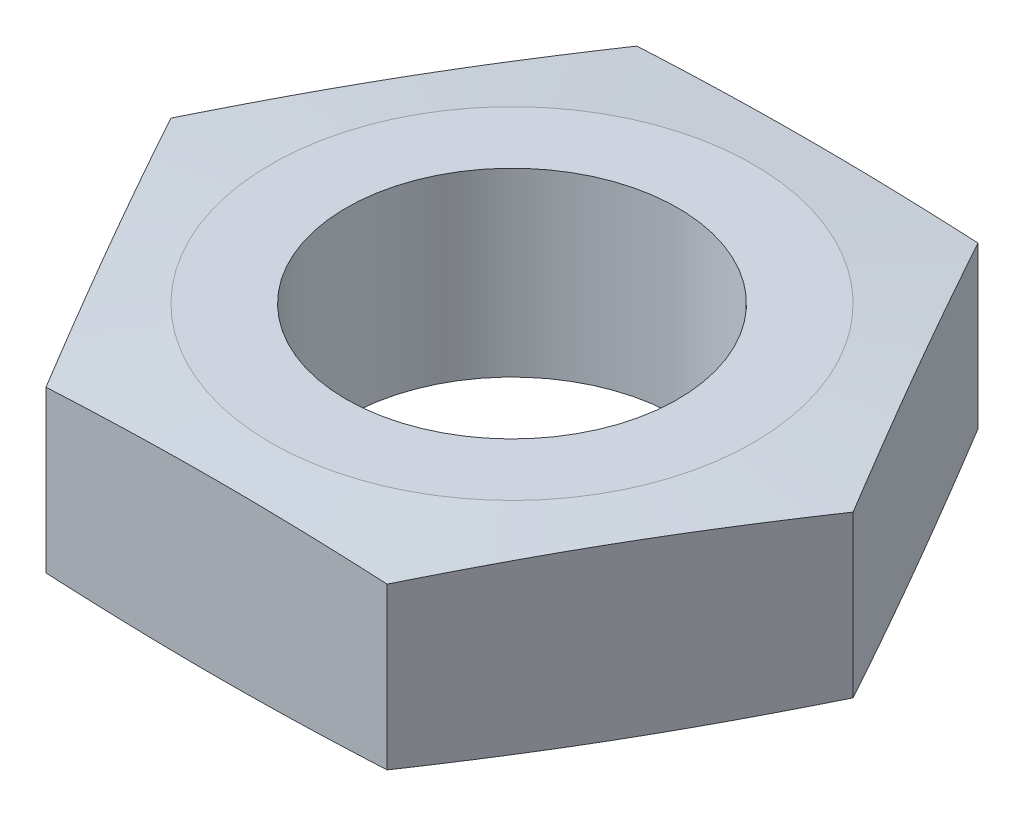
ISO-10303-21;
HEADER;
FILE_DESCRIPTION(('STEP AP214'),'2;1');
FILE_NAME('part.step','',(''),(''),'','','');
FILE_SCHEMA(('AUTOMOTIVE_DESIGN { 1 0 10303 214 1 1 1 1 }'));
ENDSEC;
DATA;
#1=APPLICATION_CONTEXT('core data for automotive mechanical design processes');
#2=APPLICATION_PROTOCOL_DEFINITION('international standard','automotive_design',2000,#1);
#3=PRODUCT_CONTEXT('',#1,'mechanical');
#4=PRODUCT('Part','Part','',(#3));
#5=PRODUCT_RELATED_PRODUCT_CATEGORY('part','',(#4));
#6=PRODUCT_DEFINITION_FORMATION('','',#4);
#7=PRODUCT_DEFINITION_CONTEXT('part definition',#1,'design');
#8=PRODUCT_DEFINITION('design','',#6,#7);
#9=PRODUCT_DEFINITION_SHAPE('','',#8);
#10=(LENGTH_UNIT() NAMED_UNIT(*) SI_UNIT(.MILLI.,.METRE.));
#11=(NAMED_UNIT(*) PLANE_ANGLE_UNIT() SI_UNIT($,.RADIAN.));
#12=(NAMED_UNIT(*) SI_UNIT($,.STERADIAN.) SOLID_ANGLE_UNIT());
#13=UNCERTAINTY_MEASURE_WITH_UNIT(LENGTH_MEASURE(1.E-05),#10,'distance_accuracy_value','');
#14=(GEOMETRIC_REPRESENTATION_CONTEXT(3) GLOBAL_UNCERTAINTY_ASSIGNED_CONTEXT((#13)) GLOBAL_UNIT_ASSIGNED_CONTEXT((#10,
#11,#12)) REPRESENTATION_CONTEXT('',''));
#15=CARTESIAN_POINT('',(0.,0.,0.));
#16=DIRECTION('',(0.,0.,1.));
#17=DIRECTION('',(1.,0.,0.));
#18=AXIS2_PLACEMENT_3D('',#15,#16,#17);
#19=CARTESIAN_POINT('',(-2.82901631902917,1.5,4.9));
#20=DIRECTION('',(0.,0.,-1.));
#21=DIRECTION('',(-1.,0.,0.));
#22=AXIS2_PLACEMENT_3D('',#19,#20,#21);
#23=PLANE('',#22);
#24=CARTESIAN_POINT('',(-7.47109907735667,-1.00653863304741,4.9));
#25=CARTESIAN_POINT('',(-7.24856236014099,-1.02514412298883,4.9));
#26=CARTESIAN_POINT('',(-7.02600547216599,-1.04350771336726,4.9));
#27=CARTESIAN_POINT('',(-6.58084135956366,-1.0796312885138,4.9));
#28=CARTESIAN_POINT('',(-6.35823413462823,-1.09739126948086,4.9));
#29=CARTESIAN_POINT('',(-5.69026658544264,-1.14959039421229,4.9));
#30=CARTESIAN_POINT('',(-5.24481993569117,-1.18294367654422,4.9));
#31=CARTESIAN_POINT('',(-4.35409507703629,-1.24527219436755,4.9));
#32=CARTESIAN_POINT('',(-3.90881719743005,-1.27425207364141,4.9));
#33=CARTESIAN_POINT('',(-3.01787712788772,-1.32566836961985,4.9));
#34=CARTESIAN_POINT('',(-2.5722149480883,-1.34810495392267,4.9));
#35=CARTESIAN_POINT('',(-1.90310838277142,-1.37473844982548,4.9));
#36=CARTESIAN_POINT('',(-1.67980405540288,-1.38244917287994,4.9));
#37=CARTESIAN_POINT('',(-1.23311960808795,-1.39517553267675,4.9));
#38=CARTESIAN_POINT('',(-1.00973948903471,-1.40019120014511,4.9));
#39=CARTESIAN_POINT('',(-0.562943374380458,-1.40726997751627,4.9));
#40=CARTESIAN_POINT('',(-0.339527381266118,-1.40933324179001,4.9));
#41=CARTESIAN_POINT('',(0.107311956766196,-1.41039167435151,4.9));
#42=CARTESIAN_POINT('',(0.330735301682421,-1.40938684336388,4.9));
#43=CARTESIAN_POINT('',(0.777659835380096,-1.40436501603405,4.9));
#44=CARTESIAN_POINT('',(1.00116100688973,-1.40034650689583,4.9));
#45=CARTESIAN_POINT('',(1.44809643611479,-1.38951062191602,4.9));
#46=CARTESIAN_POINT('',(1.67153069306241,-1.38269321510401,4.9));
#47=CARTESIAN_POINT('',(2.34172762215674,-1.35852085026062,4.9));
#48=CARTESIAN_POINT('',(2.78835626533211,-1.33744613842943,4.9));
#49=CARTESIAN_POINT('',(3.66354970944947,-1.28923839010267,4.9));
#50=CARTESIAN_POINT('',(4.09213031646093,-1.26237792602413,4.9));
#51=CARTESIAN_POINT('',(4.94899907590043,-1.20427282978973,4.9));
#52=CARTESIAN_POINT('',(5.37728722203045,-1.17302810603745,4.9));
#53=CARTESIAN_POINT('',(6.23365739957386,-1.10758374437045,4.9));
#54=CARTESIAN_POINT('',(6.6617394188844,-1.07338395021818,4.9));
#55=CARTESIAN_POINT('',(7.51773771687456,-1.00296419443362,4.9));
#56=CARTESIAN_POINT('',(7.94565399497719,-0.96674422583106,4.9));
#57=CARTESIAN_POINT('',(8.80076818602211,-0.892939677446466,4.9));
#58=CARTESIAN_POINT('',(9.22796626975954,-0.855357067420007,4.9));
#59=CARTESIAN_POINT('',(10.0822727519871,-0.779174551195442,4.9));
#60=CARTESIAN_POINT('',(10.5093811502087,-0.740574641995029,4.9));
#61=CARTESIAN_POINT('',(11.3634348139587,-0.662635675856532,4.9));
#62=CARTESIAN_POINT('',(11.7903800946575,-0.623296784778671,4.9));
#63=CARTESIAN_POINT('',(12.6442150050174,-0.544044031663291,4.9));
#64=CARTESIAN_POINT('',(13.0711046349661,-0.504130172726609,4.9));
#65=CARTESIAN_POINT('',(13.4979750990547,-0.464014861585602,4.9));
#66=B_SPLINE_CURVE_WITH_KNOTS('',3,(#24,#25,#26,#27,#28,#29,#30,#31,#32,#33,#34,#35,#36,#37,#38,
#39,#40,#41,#42,#43,#44,#45,#46,#47,#48,#49,#50,#51,#52,#53,#54,#55,#56,#57,#58,#59,#60,#61,#62,
#63,#64,#65),.UNSPECIFIED.,.F.,.F.,(4,2,2,2,2,2,2,2,2,2,2,2,2,2,2,2,2,2,2,2,4),(0.,
0.669938984867388,1.33988218769278,2.67994787700641,4.01858048683973,5.35717880627859,
6.02747745062249,6.69776845281103,7.36802440652299,8.0382802019385,8.70887267549961,
9.37947256951599,10.7207569059899,12.0089933497948,13.2972567115822,14.5855882268773,
15.8739241876202,17.1604667542172,18.4470131181527,19.7332740949343,21.0195281374242),.UNSPECIFIED.);
#67=CARTESIAN_POINT('',(2.82901631902916,-1.33419673619417,4.9));
#68=VERTEX_POINT('',#67);
#69=CARTESIAN_POINT('',(-2.82901631902917,-1.33419673619417,4.9));
#70=VERTEX_POINT('',#69);
#71=EDGE_CURVE('E38',#68,#70,#66,.F.);
#72=ORIENTED_EDGE('',*,*,#71,.F.);
#73=DIRECTION('',(0.,-1.,0.));
#74=VECTOR('',#73,1.);
#75=CARTESIAN_POINT('',(2.82901631902916,1.5,4.9));
#76=LINE('',#75,#74);
#77=CARTESIAN_POINT('',(2.82901631902916,1.33419673619417,4.9));
#78=VERTEX_POINT('',#77);
#79=EDGE_CURVE('E31',#78,#68,#76,.T.);
#80=ORIENTED_EDGE('',*,*,#79,.F.);
#81=CARTESIAN_POINT('',(-7.47109907735667,1.00653863304741,4.9));
#82=CARTESIAN_POINT('',(-7.24856236014099,1.02514412298883,4.9));
#83=CARTESIAN_POINT('',(-7.02600547216599,1.04350771336726,4.9));
#84=CARTESIAN_POINT('',(-6.58084135956366,1.0796312885138,4.9));
#85=CARTESIAN_POINT('',(-6.35823413462823,1.09739126948086,4.9));
#86=CARTESIAN_POINT('',(-5.69026658544264,1.14959039421229,4.9));
#87=CARTESIAN_POINT('',(-5.24481993569117,1.18294367654422,4.9));
#88=CARTESIAN_POINT('',(-4.35409507703629,1.24527219436755,4.9));
#89=CARTESIAN_POINT('',(-3.90881719743005,1.27425207364141,4.9));
#90=CARTESIAN_POINT('',(-3.01787712788772,1.32566836961985,4.9));
#91=CARTESIAN_POINT('',(-2.5722149480883,1.34810495392267,4.9));
#92=CARTESIAN_POINT('',(-1.90310838277142,1.37473844982548,4.9));
#93=CARTESIAN_POINT('',(-1.67980405540288,1.38244917287994,4.9));
#94=CARTESIAN_POINT('',(-1.23311960808795,1.39517553267675,4.9));
#95=CARTESIAN_POINT('',(-1.00973948903471,1.40019120014511,4.9));
#96=CARTESIAN_POINT('',(-0.562943374380458,1.40726997751627,4.9));
#97=CARTESIAN_POINT('',(-0.339527381266118,1.40933324179001,4.9));
#98=CARTESIAN_POINT('',(0.107311956766196,1.41039167435151,4.9));
#99=CARTESIAN_POINT('',(0.330735301682421,1.40938684336388,4.9));
#100=CARTESIAN_POINT('',(0.777659835380096,1.40436501603405,4.9));
#101=CARTESIAN_POINT('',(1.00116100688973,1.40034650689583,4.9));
#102=CARTESIAN_POINT('',(1.44809643611479,1.38951062191602,4.9));
#103=CARTESIAN_POINT('',(1.67153069306241,1.38269321510401,4.9));
#104=CARTESIAN_POINT('',(2.34172762215674,1.35852085026062,4.9));
#105=CARTESIAN_POINT('',(2.78835626533211,1.33744613842943,4.9));
#106=CARTESIAN_POINT('',(3.66354970944947,1.28923839010267,4.9));
#107=CARTESIAN_POINT('',(4.09213031646093,1.26237792602413,4.9));
#108=CARTESIAN_POINT('',(4.94899907590043,1.20427282978973,4.9));
#109=CARTESIAN_POINT('',(5.37728722203045,1.17302810603745,4.9));
#110=CARTESIAN_POINT('',(6.23365739957386,1.10758374437045,4.9));
#111=CARTESIAN_POINT('',(6.6617394188844,1.07338395021818,4.9));
#112=CARTESIAN_POINT('',(7.51773771687456,1.00296419443362,4.9));
#113=CARTESIAN_POINT('',(7.94565399497719,0.96674422583106,4.9));
#114=CARTESIAN_POINT('',(8.80076818602211,0.892939677446466,4.9));
#115=CARTESIAN_POINT('',(9.22796626975954,0.855357067420007,4.9));
#116=CARTESIAN_POINT('',(10.0822727519871,0.779174551195442,4.9));
#117=CARTESIAN_POINT('',(10.5093811502087,0.740574641995029,4.9));
#118=CARTESIAN_POINT('',(11.3634348139587,0.662635675856532,4.9));
#119=CARTESIAN_POINT('',(11.7903800946575,0.623296784778671,4.9));
#120=CARTESIAN_POINT('',(12.6442150050174,0.544044031663291,4.9));
#121=CARTESIAN_POINT('',(13.0711046349661,0.504130172726609,4.9));
#122=CARTESIAN_POINT('',(13.4979750990547,0.464014861585602,4.9));
#123=B_SPLINE_CURVE_WITH_KNOTS('',3,(#81,#82,#83,#84,#85,#86,#87,#88,#89,#90,#91,#92,#93,#94,
#95,#96,#97,#98,#99,#100,#101,#102,#103,#104,#105,#106,#107,#108,#109,#110,#111,#112,#113,#114,
#115,#116,#117,#118,#119,#120,#121,#122),.UNSPECIFIED.,.F.,.F.,(4,2,2,2,2,2,2,2,2,2,2,2,2,2,2,2,
2,2,2,2,4),(0.,0.669938984867388,1.33988218769278,2.67994787700641,4.01858048683973,
5.35717880627859,6.02747745062249,6.69776845281103,7.36802440652299,8.0382802019385,
8.70887267549961,9.37947256951599,10.7207569059899,12.0089933497948,13.2972567115822,
14.5855882268773,15.8739241876202,17.1604667542172,18.4470131181527,19.7332740949343,
21.0195281374242),.UNSPECIFIED.);
#124=CARTESIAN_POINT('',(-2.82901631902917,1.33419673619417,4.9));
#125=VERTEX_POINT('',#124);
#126=EDGE_CURVE('E116',#125,#78,#123,.T.);
#127=ORIENTED_EDGE('',*,*,#126,.F.);
#128=DIRECTION('',(0.,-1.,0.));
#129=VECTOR('',#128,1.);
#130=CARTESIAN_POINT('',(-2.82901631902917,1.5,4.9));
#131=LINE('',#130,#129);
#132=EDGE_CURVE('E93',#125,#70,#131,.T.);
#133=ORIENTED_EDGE('',*,*,#132,.T.);
#134=EDGE_LOOP('',(#72,#80,#127,#133));
#135=FACE_BOUND('',#134,.T.);
#136=ADVANCED_FACE('F17',(#135),#23,.F.);
#137=CARTESIAN_POINT('',(2.82901631902916,1.5,4.9));
#138=DIRECTION('',(-0.866025403784439,0.,-0.5));
#139=DIRECTION('',(-0.5,0.,0.866025403784439));
#140=AXIS2_PLACEMENT_3D('',#137,#138,#139);
#141=PLANE('',#140);
#142=CARTESIAN_POINT('',(5.65814810811217,-1.33418518883531,-0.000199999999996242));
#143=CARTESIAN_POINT('',(5.54031817177861,-1.3459738480169,0.203887436382334));
#144=CARTESIAN_POINT('',(5.42245803825476,-1.35665356088679,0.408027175832484));
#145=CARTESIAN_POINT('',(5.18667966555825,-1.37539024798846,0.816407296668759));
#146=CARTESIAN_POINT('',(5.06876142359181,-1.38344708057591,1.02064768289384));
#147=CARTESIAN_POINT('',(4.83296724142084,-1.39652706360113,1.4290551865431));
#148=CARTESIAN_POINT('',(4.71509133240421,-1.40155240630638,1.63322224994827));
#149=CARTESIAN_POINT('',(4.479318441363,-1.40828883219344,2.04159287627904));
#150=CARTESIAN_POINT('',(4.36142145995338,-1.41,2.24579643813952));
#151=CARTESIAN_POINT('',(4.12562749713412,-1.41,2.65420356186048));
#152=CARTESIAN_POINT('',(4.00773051572449,-1.40828883219344,2.85840712372096));
#153=CARTESIAN_POINT('',(3.77195762468328,-1.40155240630638,3.26677775005173));
#154=CARTESIAN_POINT('',(3.65408171566665,-1.39652706360113,3.4709448134569));
#155=CARTESIAN_POINT('',(3.41828753349569,-1.38344708057591,3.87935231710616));
#156=CARTESIAN_POINT('',(3.30036929152925,-1.37539024798846,4.08359270333124));
#157=CARTESIAN_POINT('',(3.06459091883273,-1.35665356088679,4.49197282416752));
#158=CARTESIAN_POINT('',(2.94673078530889,-1.3459738480169,4.69611256361767));
#159=CARTESIAN_POINT('',(2.82890084897533,-1.33418518883531,4.9002));
#160=B_SPLINE_CURVE_WITH_KNOTS('',3,(#142,#143,#144,#145,#146,#147,#148,#149,#150,#151,#152,
#153,#154,#155,#156,#157,#158,#159),.UNSPECIFIED.,.F.,.F.,(4,2,2,2,2,2,2,2,4),(0.,
0.707868433880265,1.41577508869476,2.12316919454419,2.83054523742568,3.53792128030717,
4.2453153861566,4.9532220409711,5.66109047485136),.UNSPECIFIED.);
#161=CARTESIAN_POINT('',(5.65803263805833,-1.33419673619417,0.));
#162=VERTEX_POINT('',#161);
#163=EDGE_CURVE('E112',#162,#68,#160,.T.);
#164=ORIENTED_EDGE('',*,*,#163,.F.);
#165=DIRECTION('',(0.,-1.,0.));
#166=VECTOR('',#165,1.);
#167=CARTESIAN_POINT('',(5.65803263805833,1.5,0.));
#168=LINE('',#167,#166);
#169=CARTESIAN_POINT('',(5.65803263805833,1.33419673619417,0.));
#170=VERTEX_POINT('',#169);
#171=EDGE_CURVE('E103',#170,#162,#168,.T.);
#172=ORIENTED_EDGE('',*,*,#171,.F.);
#173=CARTESIAN_POINT('',(2.82890084897533,1.33418518883531,4.9002));
#174=CARTESIAN_POINT('',(2.94673078530889,1.3459738480169,4.69611256361767));
#175=CARTESIAN_POINT('',(3.06459091883273,1.35665356088679,4.49197282416752));
#176=CARTESIAN_POINT('',(3.30036929152925,1.37539024798846,4.08359270333124));
#177=CARTESIAN_POINT('',(3.41828753349569,1.38344708057591,3.87935231710616));
#178=CARTESIAN_POINT('',(3.65408171566665,1.39652706360113,3.4709448134569));
#179=CARTESIAN_POINT('',(3.77195762468328,1.40155240630638,3.26677775005173));
#180=CARTESIAN_POINT('',(4.00773051572449,1.40828883219344,2.85840712372096));
#181=CARTESIAN_POINT('',(4.12562749713412,1.41,2.65420356186048));
#182=CARTESIAN_POINT('',(4.36142145995338,1.41,2.24579643813952));
#183=CARTESIAN_POINT('',(4.47931844136301,1.40828883219344,2.04159287627904));
#184=CARTESIAN_POINT('',(4.71509133240421,1.40155240630638,1.63322224994827));
#185=CARTESIAN_POINT('',(4.83296724142084,1.39652706360113,1.4290551865431));
#186=CARTESIAN_POINT('',(5.06876142359181,1.38344708057591,1.02064768289384));
#187=CARTESIAN_POINT('',(5.18667966555825,1.37539024798846,0.816407296668758));
#188=CARTESIAN_POINT('',(5.42245803825476,1.35665356088679,0.408027175832483));
#189=CARTESIAN_POINT('',(5.54031817177861,1.3459738480169,0.203887436382333));
#190=CARTESIAN_POINT('',(5.65814810811217,1.33418518883531,-0.000199999999997153));
#191=B_SPLINE_CURVE_WITH_KNOTS('',3,(#173,#174,#175,#176,#177,#178,#179,#180,#181,#182,#183,
#184,#185,#186,#187,#188,#189,#190),.UNSPECIFIED.,.F.,.F.,(4,2,2,2,2,2,2,2,4),(0.,
0.707868433880266,1.41577508869476,2.12316919454419,2.83054523742568,3.53792128030717,
4.2453153861566,4.9532220409711,5.66109047485136),.UNSPECIFIED.);
#192=EDGE_CURVE('E113',#78,#170,#191,.T.);
#193=ORIENTED_EDGE('',*,*,#192,.F.);
#194=ORIENTED_EDGE('',*,*,#79,.T.);
#195=EDGE_LOOP('',(#164,#172,#193,#194));
#196=FACE_BOUND('',#195,.T.);
#197=ADVANCED_FACE('F110',(#196),#141,.F.);
#198=CARTESIAN_POINT('',(5.65803263805833,1.5,0.));
#199=DIRECTION('',(-0.866025403784439,0.,0.5));
#200=DIRECTION('',(0.5,0.,0.866025403784439));
#201=AXIS2_PLACEMENT_3D('',#198,#199,#200);
#202=PLANE('',#201);
#203=CARTESIAN_POINT('',(2.82890084897533,-1.33418518883531,-4.9002));
#204=CARTESIAN_POINT('',(2.94673078530889,-1.3459738480169,-4.69611256361767));
#205=CARTESIAN_POINT('',(3.06459091883273,-1.35665356088679,-4.49197282416752));
#206=CARTESIAN_POINT('',(3.30036929152925,-1.37539024798846,-4.08359270333124));
#207=CARTESIAN_POINT('',(3.41828753349569,-1.38344708057591,-3.87935231710616));
#208=CARTESIAN_POINT('',(3.65408171566665,-1.39652706360113,-3.4709448134569));
#209=CARTESIAN_POINT('',(3.77195762468328,-1.40155240630638,-3.26677775005173));
#210=CARTESIAN_POINT('',(4.00773051572449,-1.40828883219344,-2.85840712372096));
#211=CARTESIAN_POINT('',(4.12562749713412,-1.41,-2.65420356186048));
#212=CARTESIAN_POINT('',(4.36142145995338,-1.41,-2.24579643813952));
#213=CARTESIAN_POINT('',(4.47931844136301,-1.40828883219344,-2.04159287627904));
#214=CARTESIAN_POINT('',(4.71509133240421,-1.40155240630638,-1.63322224994827));
#215=CARTESIAN_POINT('',(4.83296724142084,-1.39652706360113,-1.42905518654309));
#216=CARTESIAN_POINT('',(5.06876142359181,-1.38344708057591,-1.02064768289383));
#217=CARTESIAN_POINT('',(5.18667966555825,-1.37539024798846,-0.816407296668754));
#218=CARTESIAN_POINT('',(5.42245803825476,-1.35665356088679,-0.408027175832479));
#219=CARTESIAN_POINT('',(5.54031817177861,-1.3459738480169,-0.203887436382328));
#220=CARTESIAN_POINT('',(5.65814810811217,-1.33418518883531,0.000200000000003215));
#221=B_SPLINE_CURVE_WITH_KNOTS('',3,(#203,#204,#205,#206,#207,#208,#209,#210,#211,#212,#213,
#214,#215,#216,#217,#218,#219,#220),.UNSPECIFIED.,.F.,.F.,(4,2,2,2,2,2,2,2,4),(0.,
0.707868433880266,1.41577508869476,2.12316919454419,2.83054523742568,3.53792128030718,
4.24531538615661,4.9532220409711,5.66109047485137),.UNSPECIFIED.);
#222=CARTESIAN_POINT('',(2.82901631902916,-1.33419673619417,-4.9));
#223=VERTEX_POINT('',#222);
#224=EDGE_CURVE('E121',#223,#162,#221,.T.);
#225=ORIENTED_EDGE('',*,*,#224,.F.);
#226=DIRECTION('',(0.,-1.,0.));
#227=VECTOR('',#226,1.);
#228=CARTESIAN_POINT('',(2.82901631902916,1.5,-4.9));
#229=LINE('',#228,#227);
#230=CARTESIAN_POINT('',(2.82901631902916,1.33419673619417,-4.9));
#231=VERTEX_POINT('',#230);
#232=EDGE_CURVE('E95',#231,#223,#229,.T.);
#233=ORIENTED_EDGE('',*,*,#232,.F.);
#234=CARTESIAN_POINT('',(5.65814810811217,1.33418518883531,0.000200000000003808));
#235=CARTESIAN_POINT('',(5.54031817177861,1.3459738480169,-0.203887436382327));
#236=CARTESIAN_POINT('',(5.42245803825476,1.35665356088679,-0.408027175832478));
#237=CARTESIAN_POINT('',(5.18667966555825,1.37539024798846,-0.816407296668753));
#238=CARTESIAN_POINT('',(5.06876142359181,1.38344708057591,-1.02064768289383));
#239=CARTESIAN_POINT('',(4.83296724142084,1.39652706360113,-1.42905518654309));
#240=CARTESIAN_POINT('',(4.71509133240421,1.40155240630638,-1.63322224994826));
#241=CARTESIAN_POINT('',(4.47931844136301,1.40828883219344,-2.04159287627904));
#242=CARTESIAN_POINT('',(4.36142145995338,1.41,-2.24579643813952));
#243=CARTESIAN_POINT('',(4.12562749713412,1.41,-2.65420356186048));
#244=CARTESIAN_POINT('',(4.00773051572449,1.40828883219344,-2.85840712372096));
#245=CARTESIAN_POINT('',(3.77195762468328,1.40155240630638,-3.26677775005173));
#246=CARTESIAN_POINT('',(3.65408171566665,1.39652706360113,-3.4709448134569));
#247=CARTESIAN_POINT('',(3.41828753349569,1.38344708057591,-3.87935231710616));
#248=CARTESIAN_POINT('',(3.30036929152925,1.37539024798846,-4.08359270333124));
#249=CARTESIAN_POINT('',(3.06459091883273,1.35665356088679,-4.49197282416752));
#250=CARTESIAN_POINT('',(2.94673078530889,1.3459738480169,-4.69611256361767));
#251=CARTESIAN_POINT('',(2.82890084897533,1.33418518883531,-4.9002));
#252=B_SPLINE_CURVE_WITH_KNOTS('',3,(#234,#235,#236,#237,#238,#239,#240,#241,#242,#243,#244,
#245,#246,#247,#248,#249,#250,#251),.UNSPECIFIED.,.F.,.F.,(4,2,2,2,2,2,2,2,4),(0.,
0.707868433880265,1.41577508869476,2.12316919454419,2.83054523742568,3.53792128030718,
4.24531538615661,4.9532220409711,5.66109047485137),.UNSPECIFIED.);
#253=EDGE_CURVE('E175',#170,#231,#252,.T.);
#254=ORIENTED_EDGE('',*,*,#253,.F.);
#255=ORIENTED_EDGE('',*,*,#171,.T.);
#256=EDGE_LOOP('',(#225,#233,#254,#255));
#257=FACE_BOUND('',#256,.T.);
#258=ADVANCED_FACE('F166',(#257),#202,.F.);
#259=CARTESIAN_POINT('',(2.82901631902916,1.5,-4.9));
#260=DIRECTION('',(0.,0.,1.));
#261=DIRECTION('',(1.,0.,0.));
#262=AXIS2_PLACEMENT_3D('',#259,#260,#261);
#263=PLANE('',#262);
#264=CARTESIAN_POINT('',(-7.47107277086338,-1.00654083278789,-4.9));
#265=CARTESIAN_POINT('',(-7.24853714490946,-1.02514621180149,-4.9));
#266=CARTESIAN_POINT('',(-7.02598134826093,-1.0435096917819,-4.9));
#267=CARTESIAN_POINT('',(-6.58081941853175,-1.07963304802484,-4.9));
#268=CARTESIAN_POINT('',(-6.358213285143,-1.09739292048635,-4.9));
#269=CARTESIAN_POINT('',(-5.69024901205752,-1.14959172370627,-4.9));
#270=CARTESIAN_POINT('',(-5.24480454729595,-1.18294479712945,-4.9));
#271=CARTESIAN_POINT('',(-4.35408405302938,-1.24527292196112,-4.9));
#272=CARTESIAN_POINT('',(-3.90880835281549,-1.27425261707341,-4.9));
#273=CARTESIAN_POINT('',(-3.01787264548786,-1.32566859540431,-4.9));
#274=CARTESIAN_POINT('',(-2.5722126485105,-1.34810504621666,-4.9));
#275=CARTESIAN_POINT('',(-1.90310937540869,-1.37473840993395,-4.9));
#276=CARTESIAN_POINT('',(-1.67980615603825,-1.38244910014281,-4.9));
#277=CARTESIAN_POINT('',(-1.23312392535325,-1.39517542255663,-4.9));
#278=CARTESIAN_POINT('',(-1.00974491493181,-1.4001910854869,-4.9));
#279=CARTESIAN_POINT('',(-0.562951017484857,-1.40726988509464,-4.9));
#280=CARTESIAN_POINT('',(-0.339536132945977,-1.40933317613975,-4.9));
#281=CARTESIAN_POINT('',(0.107300988481997,-1.41039169328556,-4.9));
#282=CARTESIAN_POINT('',(0.330723225369342,-1.40938692011092,-4.9));
#283=CARTESIAN_POINT('',(0.77764554295953,-1.40436523562848,-4.9));
#284=CARTESIAN_POINT('',(1.00114560639122,-1.40034681154665,-4.9));
#285=CARTESIAN_POINT('',(1.44807882081598,-1.3895111177824,-4.9));
#286=CARTESIAN_POINT('',(1.67151197104126,-1.38269381713022,-4.9));
#287=CARTESIAN_POINT('',(2.34170558124876,-1.3585217917536,-4.9));
#288=CARTESIAN_POINT('',(2.78833201428591,-1.33744733419746,-4.9));
#289=CARTESIAN_POINT('',(3.66352325713748,-1.28923998222644,-4.9));
#290=CARTESIAN_POINT('',(4.0921038710274,-1.26237962743646,-4.9));
#291=CARTESIAN_POINT('',(4.9489726427726,-1.20427471394331,-4.9));
#292=CARTESIAN_POINT('',(5.37726079432968,-1.17303006364109,-4.9));
#293=CARTESIAN_POINT('',(6.23363098259055,-1.10758582507736,-4.9));
#294=CARTESIAN_POINT('',(6.66171300719073,-1.07338608056823,-4.9));
#295=CARTESIAN_POINT('',(7.51771131470573,-1.00296640876898,-4.9));
#296=CARTESIAN_POINT('',(7.94562759704353,-0.966746474508401,-4.9));
#297=CARTESIAN_POINT('',(8.80074180078879,-0.89294198436109,-4.9));
#298=CARTESIAN_POINT('',(9.22793989299101,-0.855359398227256,-4.9));
#299=CARTESIAN_POINT('',(10.0822463916234,-0.77917692314142,-4.9));
#300=CARTESIAN_POINT('',(10.5093547977852,-0.74057703118704,-4.9));
#301=CARTESIAN_POINT('',(11.3634084745804,-0.662638095254369,-4.9));
#302=CARTESIAN_POINT('',(11.7903537603847,-0.623299217141585,-4.9));
#303=CARTESIAN_POINT('',(12.6441886806365,-0.544046486726358,-4.9));
#304=CARTESIAN_POINT('',(13.0710783153715,-0.50413263752482,-4.9));
#305=CARTESIAN_POINT('',(13.4979487841552,-0.464017335133611,-4.9));
#306=B_SPLINE_CURVE_WITH_KNOTS('',3,(#264,#265,#266,#267,#268,#269,#270,#271,#272,#273,#274,
#275,#276,#277,#278,#279,#280,#281,#282,#283,#284,#285,#286,#287,#288,#289,#290,#291,#292,#293,
#294,#295,#296,#297,#298,#299,#300,#301,#302,#303,#304,#305),.UNSPECIFIED.,.F.,.F.,(4,2,2,2,2,2,
2,2,2,2,2,2,2,2,2,2,2,2,2,2,4),(0.,0.669935694741025,1.33987560740933,2.67993471332562,
4.01856076308814,5.35715252327417,6.02744784242187,6.69773551954352,7.36798814874199,
8.03824061962697,8.70882976512751,9.37942633094186,10.7207040087734,12.0089404520295,
13.2972038138165,14.5855353329576,15.873871297627,17.1604138832166,18.446960266208,
19.7332212546681,21.0194753087295),.UNSPECIFIED.);
#307=CARTESIAN_POINT('',(-2.82901631902917,-1.33419673619417,-4.9));
#308=VERTEX_POINT('',#307);
#309=EDGE_CURVE('E90',#308,#223,#306,.T.);
#310=ORIENTED_EDGE('',*,*,#309,.F.);
#311=DIRECTION('',(0.,-1.,0.));
#312=VECTOR('',#311,1.);
#313=CARTESIAN_POINT('',(-2.82901631902917,1.5,-4.9));
#314=LINE('',#313,#312);
#315=CARTESIAN_POINT('',(-2.82901631902917,1.33419673619417,-4.9));
#316=VERTEX_POINT('',#315);
#317=EDGE_CURVE('E89',#316,#308,#314,.T.);
#318=ORIENTED_EDGE('',*,*,#317,.F.);
#319=CARTESIAN_POINT('',(-7.47107277086338,1.00654083278789,-4.9));
#320=CARTESIAN_POINT('',(-7.24853714490946,1.02514621180149,-4.9));
#321=CARTESIAN_POINT('',(-7.02598134826093,1.0435096917819,-4.9));
#322=CARTESIAN_POINT('',(-6.58081941853175,1.07963304802484,-4.9));
#323=CARTESIAN_POINT('',(-6.358213285143,1.09739292048635,-4.9));
#324=CARTESIAN_POINT('',(-5.69024901205752,1.14959172370627,-4.9));
#325=CARTESIAN_POINT('',(-5.24480454729595,1.18294479712945,-4.9));
#326=CARTESIAN_POINT('',(-4.35408405302938,1.24527292196112,-4.9));
#327=CARTESIAN_POINT('',(-3.90880835281549,1.27425261707341,-4.9));
#328=CARTESIAN_POINT('',(-3.01787264548786,1.32566859540431,-4.9));
#329=CARTESIAN_POINT('',(-2.5722126485105,1.34810504621666,-4.9));
#330=CARTESIAN_POINT('',(-1.90310937540869,1.37473840993395,-4.9));
#331=CARTESIAN_POINT('',(-1.67980615603825,1.38244910014281,-4.9));
#332=CARTESIAN_POINT('',(-1.23312392535325,1.39517542255663,-4.9));
#333=CARTESIAN_POINT('',(-1.00974491493181,1.4001910854869,-4.9));
#334=CARTESIAN_POINT('',(-0.562951017484857,1.40726988509464,-4.9));
#335=CARTESIAN_POINT('',(-0.339536132945977,1.40933317613975,-4.9));
#336=CARTESIAN_POINT('',(0.107300988481997,1.41039169328556,-4.9));
#337=CARTESIAN_POINT('',(0.330723225369342,1.40938692011092,-4.9));
#338=CARTESIAN_POINT('',(0.77764554295953,1.40436523562848,-4.9));
#339=CARTESIAN_POINT('',(1.00114560639122,1.40034681154665,-4.9));
#340=CARTESIAN_POINT('',(1.44807882081598,1.3895111177824,-4.9));
#341=CARTESIAN_POINT('',(1.67151197104126,1.38269381713022,-4.9));
#342=CARTESIAN_POINT('',(2.34170558124876,1.3585217917536,-4.9));
#343=CARTESIAN_POINT('',(2.78833201428591,1.33744733419746,-4.9));
#344=CARTESIAN_POINT('',(3.66352325713748,1.28923998222644,-4.9));
#345=CARTESIAN_POINT('',(4.0921038710274,1.26237962743646,-4.9));
#346=CARTESIAN_POINT('',(4.9489726427726,1.20427471394331,-4.9));
#347=CARTESIAN_POINT('',(5.37726079432968,1.17303006364109,-4.9));
#348=CARTESIAN_POINT('',(6.23363098259055,1.10758582507736,-4.9));
#349=CARTESIAN_POINT('',(6.66171300719073,1.07338608056823,-4.9));
#350=CARTESIAN_POINT('',(7.51771131470573,1.00296640876898,-4.9));
#351=CARTESIAN_POINT('',(7.94562759704353,0.966746474508401,-4.9));
#352=CARTESIAN_POINT('',(8.80074180078879,0.89294198436109,-4.9));
#353=CARTESIAN_POINT('',(9.22793989299101,0.855359398227256,-4.9));
#354=CARTESIAN_POINT('',(10.0822463916234,0.77917692314142,-4.9));
#355=CARTESIAN_POINT('',(10.5093547977852,0.74057703118704,-4.9));
#356=CARTESIAN_POINT('',(11.3634084745804,0.662638095254369,-4.9));
#357=CARTESIAN_POINT('',(11.7903537603847,0.623299217141585,-4.9));
#358=CARTESIAN_POINT('',(12.6441886806365,0.544046486726358,-4.9));
#359=CARTESIAN_POINT('',(13.0710783153715,0.50413263752482,-4.9));
#360=CARTESIAN_POINT('',(13.4979487841552,0.464017335133611,-4.9));
#361=B_SPLINE_CURVE_WITH_KNOTS('',3,(#319,#320,#321,#322,#323,#324,#325,#326,#327,#328,#329,
#330,#331,#332,#333,#334,#335,#336,#337,#338,#339,#340,#341,#342,#343,#344,#345,#346,#347,#348,
#349,#350,#351,#352,#353,#354,#355,#356,#357,#358,#359,#360),.UNSPECIFIED.,.F.,.F.,(4,2,2,2,2,2,
2,2,2,2,2,2,2,2,2,2,2,2,2,2,4),(0.,0.669935694741025,1.33987560740933,2.67993471332562,
4.01856076308814,5.35715252327417,6.02744784242187,6.69773551954352,7.36798814874199,
8.03824061962697,8.70882976512751,9.37942633094186,10.7207040087734,12.0089404520295,
13.2972038138165,14.5855353329576,15.873871297627,17.1604138832166,18.446960266208,
19.7332212546681,21.0194753087295),.UNSPECIFIED.);
#362=EDGE_CURVE('E182',#231,#316,#361,.F.);
#363=ORIENTED_EDGE('',*,*,#362,.F.);
#364=ORIENTED_EDGE('',*,*,#232,.T.);
#365=EDGE_LOOP('',(#310,#318,#363,#364));
#366=FACE_BOUND('',#365,.T.);
#367=ADVANCED_FACE('F169',(#366),#263,.F.);
#368=CARTESIAN_POINT('',(-2.82901631902917,1.5,-4.9));
#369=DIRECTION('',(0.866025403784439,0.,0.5));
#370=DIRECTION('',(0.5,0.,-0.866025403784439));
#371=AXIS2_PLACEMENT_3D('',#368,#369,#370);
#372=PLANE('',#371);
#373=CARTESIAN_POINT('',(-5.65814810811218,-1.33418518883531,0.000200000000003685));
#374=CARTESIAN_POINT('',(-5.54031817177862,-1.3459738480169,-0.203887436382326));
#375=CARTESIAN_POINT('',(-5.42245803825477,-1.35665356088679,-0.408027175832477));
#376=CARTESIAN_POINT('',(-5.18667966555826,-1.37539024798846,-0.816407296668753));
#377=CARTESIAN_POINT('',(-5.06876142359181,-1.38344708057591,-1.02064768289383));
#378=CARTESIAN_POINT('',(-4.83296724142085,-1.39652706360113,-1.42905518654309));
#379=CARTESIAN_POINT('',(-4.71509133240422,-1.40155240630638,-1.63322224994826));
#380=CARTESIAN_POINT('',(-4.47931844136301,-1.40828883219344,-2.04159287627903));
#381=CARTESIAN_POINT('',(-4.36142145995338,-1.41,-2.24579643813952));
#382=CARTESIAN_POINT('',(-4.12562749713413,-1.41,-2.65420356186048));
#383=CARTESIAN_POINT('',(-4.0077305157245,-1.40828883219344,-2.85840712372096));
#384=CARTESIAN_POINT('',(-3.77195762468329,-1.40155240630638,-3.26677775005173));
#385=CARTESIAN_POINT('',(-3.65408171566666,-1.39652706360113,-3.4709448134569));
#386=CARTESIAN_POINT('',(-3.41828753349569,-1.38344708057591,-3.87935231710616));
#387=CARTESIAN_POINT('',(-3.30036929152925,-1.37539024798846,-4.08359270333124));
#388=CARTESIAN_POINT('',(-3.06459091883274,-1.35665356088679,-4.49197282416752));
#389=CARTESIAN_POINT('',(-2.94673078530889,-1.3459738480169,-4.69611256361767));
#390=CARTESIAN_POINT('',(-2.82890084897533,-1.33418518883531,-4.9002));
#391=B_SPLINE_CURVE_WITH_KNOTS('',3,(#373,#374,#375,#376,#377,#378,#379,#380,#381,#382,#383,
#384,#385,#386,#387,#388,#389,#390),.UNSPECIFIED.,.F.,.F.,(4,2,2,2,2,2,2,2,4),(0.,
0.707868433880266,1.41577508869476,2.12316919454419,2.83054523742568,3.53792128030718,
4.24531538615661,4.9532220409711,5.66109047485137),.UNSPECIFIED.);
#392=CARTESIAN_POINT('',(-5.65803263805834,-1.33419673619417,0.));
#393=VERTEX_POINT('',#392);
#394=EDGE_CURVE('E75',#393,#308,#391,.T.);
#395=ORIENTED_EDGE('',*,*,#394,.F.);
#396=DIRECTION('',(0.,-1.,0.));
#397=VECTOR('',#396,1.);
#398=CARTESIAN_POINT('',(-5.65803263805834,1.5,0.));
#399=LINE('',#398,#397);
#400=CARTESIAN_POINT('',(-5.65803263805834,1.33419673619417,0.));
#401=VERTEX_POINT('',#400);
#402=EDGE_CURVE('E87',#401,#393,#399,.T.);
#403=ORIENTED_EDGE('',*,*,#402,.F.);
#404=CARTESIAN_POINT('',(-2.82890084897533,1.33418518883531,-4.9002));
#405=CARTESIAN_POINT('',(-2.94673078530889,1.3459738480169,-4.69611256361767));
#406=CARTESIAN_POINT('',(-3.06459091883274,1.35665356088679,-4.49197282416752));
#407=CARTESIAN_POINT('',(-3.30036929152925,1.37539024798846,-4.08359270333124));
#408=CARTESIAN_POINT('',(-3.4182875334957,1.38344708057591,-3.87935231710616));
#409=CARTESIAN_POINT('',(-3.65408171566666,1.39652706360113,-3.4709448134569));
#410=CARTESIAN_POINT('',(-3.77195762468329,1.40155240630638,-3.26677775005173));
#411=CARTESIAN_POINT('',(-4.0077305157245,1.40828883219344,-2.85840712372096));
#412=CARTESIAN_POINT('',(-4.12562749713413,1.41,-2.65420356186048));
#413=CARTESIAN_POINT('',(-4.36142145995338,1.41,-2.24579643813952));
#414=CARTESIAN_POINT('',(-4.47931844136301,1.40828883219344,-2.04159287627903));
#415=CARTESIAN_POINT('',(-4.71509133240422,1.40155240630638,-1.63322224994826));
#416=CARTESIAN_POINT('',(-4.83296724142085,1.39652706360113,-1.42905518654309));
#417=CARTESIAN_POINT('',(-5.06876142359181,1.38344708057591,-1.02064768289383));
#418=CARTESIAN_POINT('',(-5.18667966555826,1.37539024798846,-0.816407296668753));
#419=CARTESIAN_POINT('',(-5.42245803825477,1.35665356088679,-0.408027175832477));
#420=CARTESIAN_POINT('',(-5.54031817177862,1.3459738480169,-0.203887436382326));
#421=CARTESIAN_POINT('',(-5.65814810811218,1.33418518883531,0.000200000000004734));
#422=B_SPLINE_CURVE_WITH_KNOTS('',3,(#404,#405,#406,#407,#408,#409,#410,#411,#412,#413,#414,
#415,#416,#417,#418,#419,#420,#421),.UNSPECIFIED.,.F.,.F.,(4,2,2,2,2,2,2,2,4),(0.,
0.707868433880266,1.41577508869476,2.12316919454419,2.83054523742568,3.53792128030718,
4.24531538615661,4.9532220409711,5.66109047485137),.UNSPECIFIED.);
#423=EDGE_CURVE('E45',#316,#401,#422,.T.);
#424=ORIENTED_EDGE('',*,*,#423,.F.);
#425=ORIENTED_EDGE('',*,*,#317,.T.);
#426=EDGE_LOOP('',(#395,#403,#424,#425));
#427=FACE_BOUND('',#426,.T.);
#428=ADVANCED_FACE('F86',(#427),#372,.F.);
#429=CARTESIAN_POINT('',(-5.65803263805834,1.5,0.));
#430=DIRECTION('',(0.866025403784439,0.,-0.5));
#431=DIRECTION('',(-0.5,0.,-0.866025403784439));
#432=AXIS2_PLACEMENT_3D('',#429,#430,#431);
#433=PLANE('',#432);
#434=CARTESIAN_POINT('',(-2.82890084897533,-1.33418518883531,4.9002));
#435=CARTESIAN_POINT('',(-2.9467307853089,-1.3459738480169,4.69611256361767));
#436=CARTESIAN_POINT('',(-3.06459091883274,-1.35665356088679,4.49197282416752));
#437=CARTESIAN_POINT('',(-3.30036929152926,-1.37539024798846,4.08359270333125));
#438=CARTESIAN_POINT('',(-3.4182875334957,-1.38344708057591,3.87935231710617));
#439=CARTESIAN_POINT('',(-3.65408171566666,-1.39652706360113,3.47094481345691));
#440=CARTESIAN_POINT('',(-3.77195762468329,-1.40155240630638,3.26677775005173));
#441=CARTESIAN_POINT('',(-4.0077305157245,-1.40828883219344,2.85840712372097));
#442=CARTESIAN_POINT('',(-4.12562749713413,-1.41,2.65420356186049));
#443=CARTESIAN_POINT('',(-4.36142145995339,-1.41,2.24579643813952));
#444=CARTESIAN_POINT('',(-4.47931844136301,-1.40828883219344,2.04159287627904));
#445=CARTESIAN_POINT('',(-4.71509133240422,-1.40155240630638,1.63322224994827));
#446=CARTESIAN_POINT('',(-4.83296724142085,-1.39652706360113,1.4290551865431));
#447=CARTESIAN_POINT('',(-5.06876142359182,-1.38344708057591,1.02064768289384));
#448=CARTESIAN_POINT('',(-5.18667966555826,-1.37539024798846,0.816407296668765));
#449=CARTESIAN_POINT('',(-5.42245803825477,-1.35665356088679,0.408027175832489));
#450=CARTESIAN_POINT('',(-5.54031817177861,-1.3459738480169,0.203887436382338));
#451=CARTESIAN_POINT('',(-5.65814810811217,-1.33418518883531,-0.00019999999999537));
#452=B_SPLINE_CURVE_WITH_KNOTS('',3,(#434,#435,#436,#437,#438,#439,#440,#441,#442,#443,#444,
#445,#446,#447,#448,#449,#450,#451),.UNSPECIFIED.,.F.,.F.,(4,2,2,2,2,2,2,2,4),(0.,
0.707868433880264,1.41577508869476,2.12316919454419,2.83054523742568,3.53792128030717,
4.2453153861566,4.95322204097109,5.66109047485136),.UNSPECIFIED.);
#453=EDGE_CURVE('E72',#70,#393,#452,.T.);
#454=ORIENTED_EDGE('',*,*,#453,.F.);
#455=ORIENTED_EDGE('',*,*,#132,.F.);
#456=CARTESIAN_POINT('',(-5.65814810811218,1.33418518883531,-0.000199999999996584));
#457=CARTESIAN_POINT('',(-5.54031817177862,1.3459738480169,0.203887436382334));
#458=CARTESIAN_POINT('',(-5.42245803825478,1.35665356088679,0.408027175832485));
#459=CARTESIAN_POINT('',(-5.18667966555826,1.37539024798846,0.81640729666876));
#460=CARTESIAN_POINT('',(-5.06876142359182,1.38344708057591,1.02064768289384));
#461=CARTESIAN_POINT('',(-4.83296724142085,1.39652706360113,1.4290551865431));
#462=CARTESIAN_POINT('',(-4.71509133240422,1.40155240630638,1.63322224994827));
#463=CARTESIAN_POINT('',(-4.47931844136302,1.40828883219344,2.04159287627904));
#464=CARTESIAN_POINT('',(-4.36142145995339,1.41,2.24579643813952));
#465=CARTESIAN_POINT('',(-4.12562749713413,1.41,2.65420356186048));
#466=CARTESIAN_POINT('',(-4.0077305157245,1.40828883219344,2.85840712372096));
#467=CARTESIAN_POINT('',(-3.77195762468329,1.40155240630638,3.26677775005173));
#468=CARTESIAN_POINT('',(-3.65408171566666,1.39652706360113,3.47094481345691));
#469=CARTESIAN_POINT('',(-3.4182875334957,1.38344708057591,3.87935231710617));
#470=CARTESIAN_POINT('',(-3.30036929152926,1.37539024798846,4.08359270333124));
#471=CARTESIAN_POINT('',(-3.06459091883274,1.35665356088679,4.49197282416752));
#472=CARTESIAN_POINT('',(-2.9467307853089,1.3459738480169,4.69611256361767));
#473=CARTESIAN_POINT('',(-2.82890084897533,1.33418518883531,4.9002));
#474=B_SPLINE_CURVE_WITH_KNOTS('',3,(#456,#457,#458,#459,#460,#461,#462,#463,#464,#465,#466,
#467,#468,#469,#470,#471,#472,#473),.UNSPECIFIED.,.F.,.F.,(4,2,2,2,2,2,2,2,4),(0.,
0.707868433880265,1.41577508869476,2.12316919454419,2.83054523742568,3.53792128030717,
4.2453153861566,4.9532220409711,5.66109047485136),.UNSPECIFIED.);
#475=EDGE_CURVE('E11',#401,#125,#474,.T.);
#476=ORIENTED_EDGE('',*,*,#475,.F.);
#477=ORIENTED_EDGE('',*,*,#402,.T.);
#478=EDGE_LOOP('',(#454,#455,#476,#477));
#479=FACE_BOUND('',#478,.T.);
#480=ADVANCED_FACE('F92',(#479),#433,.F.);
#481=CARTESIAN_POINT('',(0.,-1.5,0.));
#482=DIRECTION('',(0.,1.,0.));
#483=DIRECTION('',(0.,0.,1.));
#484=AXIS2_PLACEMENT_3D('',#481,#482,#483);
#485=PLANE('',#484);
#486=CARTESIAN_POINT('',(0.,-1.5,0.));
#487=DIRECTION('',(0.,1.,0.));
#488=DIRECTION('',(0.,0.,1.));
#489=AXIS2_PLACEMENT_3D('',#486,#487,#488);
#490=CIRCLE('',#489,2.75);
#491=CARTESIAN_POINT('',(0.,-1.5,2.75));
#492=VERTEX_POINT('',#491);
#493=EDGE_CURVE('E197',#492,#492,#490,.T.);
#494=ORIENTED_EDGE('',*,*,#493,.T.);
#495=EDGE_LOOP('',(#494));
#496=FACE_BOUND('',#495,.T.);
#497=CARTESIAN_POINT('',(0.,-1.5,0.));
#498=DIRECTION('',(0.,1.,0.));
#499=DIRECTION('',(0.,0.,1.));
#500=AXIS2_PLACEMENT_3D('',#497,#498,#499);
#501=CIRCLE('',#500,4.);
#502=CARTESIAN_POINT('',(0.,-1.5,4.));
#503=VERTEX_POINT('',#502);
#504=EDGE_CURVE('E81',#503,#503,#501,.T.);
#505=ORIENTED_EDGE('',*,*,#504,.F.);
#506=EDGE_LOOP('',(#505));
#507=FACE_BOUND('',#506,.T.);
#508=ADVANCED_FACE('F202',(#496,#507),#485,.F.);
#509=CARTESIAN_POINT('',(0.,1.5,0.));
#510=DIRECTION('',(0.,1.,0.));
#511=DIRECTION('',(0.,0.,1.));
#512=AXIS2_PLACEMENT_3D('',#509,#510,#511);
#513=PLANE('',#512);
#514=CARTESIAN_POINT('',(0.,1.5,0.));
#515=DIRECTION('',(0.,1.,0.));
#516=DIRECTION('',(0.,0.,1.));
#517=AXIS2_PLACEMENT_3D('',#514,#515,#516);
#518=CIRCLE('',#517,2.75);
#519=CARTESIAN_POINT('',(0.,1.5,2.75));
#520=VERTEX_POINT('',#519);
#521=EDGE_CURVE('E97',#520,#520,#518,.T.);
#522=ORIENTED_EDGE('',*,*,#521,.F.);
#523=EDGE_LOOP('',(#522));
#524=FACE_BOUND('',#523,.T.);
#525=CARTESIAN_POINT('',(0.,1.5,0.));
#526=DIRECTION('',(0.,1.,0.));
#527=DIRECTION('',(0.,0.,1.));
#528=AXIS2_PLACEMENT_3D('',#525,#526,#527);
#529=CIRCLE('',#528,4.);
#530=CARTESIAN_POINT('',(0.,1.5,4.));
#531=VERTEX_POINT('',#530);
#532=EDGE_CURVE('E117',#531,#531,#529,.T.);
#533=ORIENTED_EDGE('',*,*,#532,.T.);
#534=EDGE_LOOP('',(#533));
#535=FACE_BOUND('',#534,.T.);
#536=ADVANCED_FACE('F207',(#524,#535),#513,.T.);
#537=CARTESIAN_POINT('',(0.,1.5,0.));
#538=DIRECTION('',(0.,-1.,0.));
#539=DIRECTION('',(0.,0.,-1.));
#540=AXIS2_PLACEMENT_3D('',#537,#538,#539);
#541=CYLINDRICAL_SURFACE('',#540,2.75);
#542=ORIENTED_EDGE('',*,*,#521,.T.);
#543=EDGE_LOOP('',(#542));
#544=FACE_BOUND('',#543,.T.);
#545=ORIENTED_EDGE('',*,*,#493,.F.);
#546=EDGE_LOOP('',(#545));
#547=FACE_BOUND('',#546,.T.);
#548=ADVANCED_FACE('F205',(#544,#547),#541,.F.);
#549=CARTESIAN_POINT('',(0.,1.5,0.));
#550=DIRECTION('',(0.,-1.,0.));
#551=DIRECTION('',(0.,0.,-1.));
#552=AXIS2_PLACEMENT_3D('',#549,#550,#551);
#553=CONICAL_SURFACE('',#552,4.,1.47112767430373);
#554=ORIENTED_EDGE('',*,*,#532,.F.);
#555=EDGE_LOOP('',(#554));
#556=FACE_BOUND('',#555,.T.);
#557=ORIENTED_EDGE('',*,*,#126,.T.);
#558=ORIENTED_EDGE('',*,*,#192,.T.);
#559=ORIENTED_EDGE('',*,*,#253,.T.);
#560=ORIENTED_EDGE('',*,*,#362,.T.);
#561=ORIENTED_EDGE('',*,*,#423,.T.);
#562=ORIENTED_EDGE('',*,*,#475,.T.);
#563=EDGE_LOOP('',(#557,#558,#559,#560,#561,#562));
#564=FACE_BOUND('',#563,.T.);
#565=ADVANCED_FACE('F136',(#556,#564),#553,.T.);
#566=CARTESIAN_POINT('',(0.,-1.5,0.));
#567=DIRECTION('',(0.,1.,0.));
#568=DIRECTION('',(0.,0.,-1.));
#569=AXIS2_PLACEMENT_3D('',#566,#567,#568);
#570=CONICAL_SURFACE('',#569,4.,1.47112767430373);
#571=ORIENTED_EDGE('',*,*,#504,.T.);
#572=EDGE_LOOP('',(#571));
#573=FACE_BOUND('',#572,.T.);
#574=ORIENTED_EDGE('',*,*,#71,.T.);
#575=ORIENTED_EDGE('',*,*,#453,.T.);
#576=ORIENTED_EDGE('',*,*,#394,.T.);
#577=ORIENTED_EDGE('',*,*,#309,.T.);
#578=ORIENTED_EDGE('',*,*,#224,.T.);
#579=ORIENTED_EDGE('',*,*,#163,.T.);
#580=EDGE_LOOP('',(#574,#575,#576,#577,#578,#579));
#581=FACE_BOUND('',#580,.T.);
#582=ADVANCED_FACE('F74',(#573,#581),#570,.T.);
#583=CLOSED_SHELL('',(#136,#197,#258,#367,#428,#480,#508,#536,#548,#565,#582));
#584=MANIFOLD_SOLID_BREP('B1',#583);
#585=ADVANCED_BREP_SHAPE_REPRESENTATION('',(#18,#584),#14);
#586=SHAPE_DEFINITION_REPRESENTATION(#9,#585);
ENDSEC;
END-ISO-10303-21;
